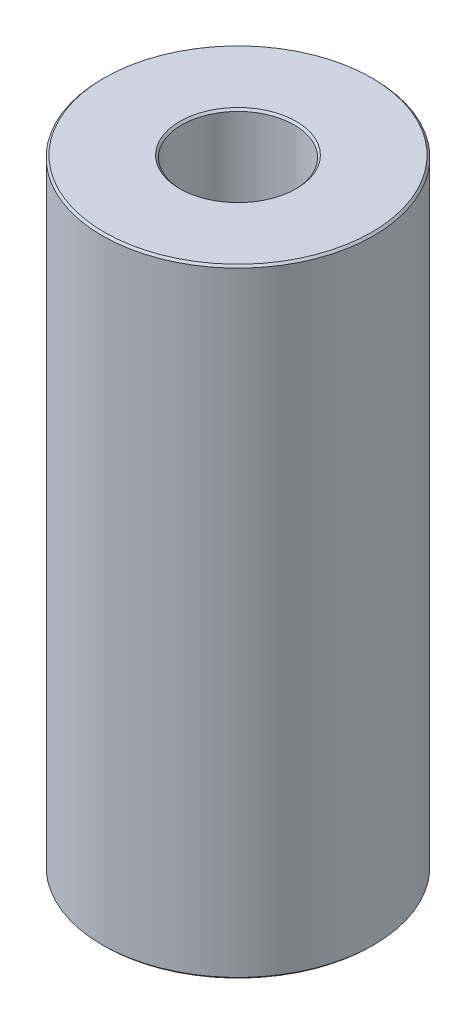
ISO-10303-21;
HEADER;
FILE_DESCRIPTION(('STEP AP214'),'2;1');
FILE_NAME('part.step','',(''),(''),'','','');
FILE_SCHEMA(('AUTOMOTIVE_DESIGN { 1 0 10303 214 1 1 1 1 }'));
ENDSEC;
DATA;
#1=APPLICATION_CONTEXT('core data for automotive mechanical design processes');
#2=APPLICATION_PROTOCOL_DEFINITION('international standard','automotive_design',2000,#1);
#3=PRODUCT_CONTEXT('',#1,'mechanical');
#4=PRODUCT('Part','Part','',(#3));
#5=PRODUCT_RELATED_PRODUCT_CATEGORY('part','',(#4));
#6=PRODUCT_DEFINITION_FORMATION('','',#4);
#7=PRODUCT_DEFINITION_CONTEXT('part definition',#1,'design');
#8=PRODUCT_DEFINITION('design','',#6,#7);
#9=PRODUCT_DEFINITION_SHAPE('','',#8);
#10=(LENGTH_UNIT() NAMED_UNIT(*) SI_UNIT(.MILLI.,.METRE.));
#11=(NAMED_UNIT(*) PLANE_ANGLE_UNIT() SI_UNIT($,.RADIAN.));
#12=(NAMED_UNIT(*) SI_UNIT($,.STERADIAN.) SOLID_ANGLE_UNIT());
#13=UNCERTAINTY_MEASURE_WITH_UNIT(LENGTH_MEASURE(1.E-05),#10,'distance_accuracy_value','');
#14=(GEOMETRIC_REPRESENTATION_CONTEXT(3) GLOBAL_UNCERTAINTY_ASSIGNED_CONTEXT((#13)) GLOBAL_UNIT_ASSIGNED_CONTEXT((#10,
#11,#12)) REPRESENTATION_CONTEXT('',''));
#15=CARTESIAN_POINT('',(0.,0.,0.));
#16=DIRECTION('',(0.,0.,1.));
#17=DIRECTION('',(1.,0.,0.));
#18=AXIS2_PLACEMENT_3D('',#15,#16,#17);
#19=CARTESIAN_POINT('',(0.,216.38670688983,0.));
#20=DIRECTION('',(0.,-1.,0.));
#21=DIRECTION('',(0.,0.,-1.));
#22=AXIS2_PLACEMENT_3D('',#19,#20,#21);
#23=CYLINDRICAL_SURFACE('',#22,47.5);
#24=CARTESIAN_POINT('',(0.,0.700210710462168,0.));
#25=DIRECTION('',(0.,1.,0.));
#26=DIRECTION('',(0.,0.,1.));
#27=AXIS2_PLACEMENT_3D('',#24,#25,#26);
#28=CIRCLE('',#27,47.5);
#29=CARTESIAN_POINT('',(0.,0.700210710462168,47.5));
#30=VERTEX_POINT('',#29);
#31=EDGE_CURVE('E10',#30,#30,#28,.T.);
#32=ORIENTED_EDGE('',*,*,#31,.T.);
#33=EDGE_LOOP('',(#32));
#34=FACE_BOUND('',#33,.T.);
#35=CARTESIAN_POINT('',(0.,215.686496179368,0.));
#36=DIRECTION('',(0.,1.,0.));
#37=DIRECTION('',(0.,0.,1.));
#38=AXIS2_PLACEMENT_3D('',#35,#36,#37);
#39=CIRCLE('',#38,47.5);
#40=CARTESIAN_POINT('',(0.,215.686496179368,47.5));
#41=VERTEX_POINT('',#40);
#42=EDGE_CURVE('E50',#41,#41,#39,.F.);
#43=ORIENTED_EDGE('',*,*,#42,.T.);
#44=EDGE_LOOP('',(#43));
#45=FACE_BOUND('',#44,.T.);
#46=ADVANCED_FACE('F39',(#34,#45),#23,.T.);
#47=CARTESIAN_POINT('',(0.,216.38670688983,0.));
#48=DIRECTION('',(0.,1.,0.));
#49=DIRECTION('',(0.,0.,1.));
#50=AXIS2_PLACEMENT_3D('',#47,#48,#49);
#51=PLANE('',#50);
#52=CARTESIAN_POINT('',(0.,216.38670688983,0.));
#53=DIRECTION('',(0.,1.,0.));
#54=DIRECTION('',(0.,0.,1.));
#55=AXIS2_PLACEMENT_3D('',#52,#53,#54);
#56=CIRCLE('',#55,20.4052724657314);
#57=CARTESIAN_POINT('',(0.,216.38670688983,20.4052724657314));
#58=VERTEX_POINT('',#57);
#59=EDGE_CURVE('E58',#58,#58,#56,.F.);
#60=ORIENTED_EDGE('',*,*,#59,.T.);
#61=EDGE_LOOP('',(#60));
#62=FACE_BOUND('',#61,.T.);
#63=CARTESIAN_POINT('',(0.,216.38670688983,0.));
#64=DIRECTION('',(0.,1.,0.));
#65=DIRECTION('',(0.,0.,1.));
#66=AXIS2_PLACEMENT_3D('',#63,#64,#65);
#67=CIRCLE('',#66,46.7997892895378);
#68=CARTESIAN_POINT('',(0.,216.38670688983,46.7997892895378));
#69=VERTEX_POINT('',#68);
#70=EDGE_CURVE('E61',#69,#69,#67,.T.);
#71=ORIENTED_EDGE('',*,*,#70,.T.);
#72=EDGE_LOOP('',(#71));
#73=FACE_BOUND('',#72,.T.);
#74=ADVANCED_FACE('F88',(#62,#73),#51,.T.);
#75=CARTESIAN_POINT('',(0.,0.,0.));
#76=DIRECTION('',(0.,1.,0.));
#77=DIRECTION('',(0.,0.,1.));
#78=AXIS2_PLACEMENT_3D('',#75,#76,#77);
#79=PLANE('',#78);
#80=CARTESIAN_POINT('',(0.,0.,0.));
#81=DIRECTION('',(0.,1.,0.));
#82=DIRECTION('',(0.,0.,1.));
#83=AXIS2_PLACEMENT_3D('',#80,#81,#82);
#84=CIRCLE('',#83,20.4052724657314);
#85=CARTESIAN_POINT('',(0.,0.,20.4052724657314));
#86=VERTEX_POINT('',#85);
#87=EDGE_CURVE('E51',#86,#86,#84,.T.);
#88=ORIENTED_EDGE('',*,*,#87,.T.);
#89=EDGE_LOOP('',(#88));
#90=FACE_BOUND('',#89,.T.);
#91=CARTESIAN_POINT('',(0.,0.,0.));
#92=DIRECTION('',(0.,1.,0.));
#93=DIRECTION('',(0.,0.,1.));
#94=AXIS2_PLACEMENT_3D('',#91,#92,#93);
#95=CIRCLE('',#94,46.7997892895378);
#96=CARTESIAN_POINT('',(0.,0.,46.7997892895378));
#97=VERTEX_POINT('',#96);
#98=EDGE_CURVE('E54',#97,#97,#95,.F.);
#99=ORIENTED_EDGE('',*,*,#98,.T.);
#100=EDGE_LOOP('',(#99));
#101=FACE_BOUND('',#100,.T.);
#102=ADVANCED_FACE('F83',(#90,#101),#79,.F.);
#103=CARTESIAN_POINT('',(0.,216.38670688983,0.));
#104=DIRECTION('',(0.,-1.,0.));
#105=DIRECTION('',(0.,0.,-1.));
#106=AXIS2_PLACEMENT_3D('',#103,#104,#105);
#107=CYLINDRICAL_SURFACE('',#106,19.7050617552692);
#108=CARTESIAN_POINT('',(0.,215.686496179368,0.));
#109=DIRECTION('',(0.,1.,0.));
#110=DIRECTION('',(0.,0.,1.));
#111=AXIS2_PLACEMENT_3D('',#108,#109,#110);
#112=CIRCLE('',#111,19.7050617552692);
#113=CARTESIAN_POINT('',(0.,215.686496179368,19.7050617552692));
#114=VERTEX_POINT('',#113);
#115=EDGE_CURVE('E67',#114,#114,#112,.T.);
#116=ORIENTED_EDGE('',*,*,#115,.T.);
#117=EDGE_LOOP('',(#116));
#118=FACE_BOUND('',#117,.T.);
#119=CARTESIAN_POINT('',(0.,0.700210710462223,0.));
#120=DIRECTION('',(0.,1.,0.));
#121=DIRECTION('',(0.,0.,1.));
#122=AXIS2_PLACEMENT_3D('',#119,#120,#121);
#123=CIRCLE('',#122,19.7050617552692);
#124=CARTESIAN_POINT('',(0.,0.700210710462223,19.7050617552692));
#125=VERTEX_POINT('',#124);
#126=EDGE_CURVE('E69',#125,#125,#123,.F.);
#127=ORIENTED_EDGE('',*,*,#126,.T.);
#128=EDGE_LOOP('',(#127));
#129=FACE_BOUND('',#128,.T.);
#130=ADVANCED_FACE('F71',(#118,#129),#107,.F.);
#131=CARTESIAN_POINT('',(0.,215.686496179368,0.));
#132=DIRECTION('',(0.,1.,0.));
#133=DIRECTION('',(0.,0.,1.));
#134=AXIS2_PLACEMENT_3D('',#131,#132,#133);
#135=CONICAL_SURFACE('',#134,19.7050617552692,0.785398163397451);
#136=ORIENTED_EDGE('',*,*,#59,.F.);
#137=EDGE_LOOP('',(#136));
#138=FACE_BOUND('',#137,.T.);
#139=ORIENTED_EDGE('',*,*,#115,.F.);
#140=EDGE_LOOP('',(#139));
#141=FACE_BOUND('',#140,.T.);
#142=ADVANCED_FACE('F77',(#138,#141),#135,.F.);
#143=CARTESIAN_POINT('',(0.,0.,0.));
#144=DIRECTION('',(0.,-1.,0.));
#145=DIRECTION('',(0.,0.,-1.));
#146=AXIS2_PLACEMENT_3D('',#143,#144,#145);
#147=CONICAL_SURFACE('',#146,20.4052724657314,0.785398163397451);
#148=ORIENTED_EDGE('',*,*,#126,.F.);
#149=EDGE_LOOP('',(#148));
#150=FACE_BOUND('',#149,.T.);
#151=ORIENTED_EDGE('',*,*,#87,.F.);
#152=EDGE_LOOP('',(#151));
#153=FACE_BOUND('',#152,.T.);
#154=ADVANCED_FACE('F73',(#150,#153),#147,.F.);
#155=CARTESIAN_POINT('',(0.,0.700210710462168,0.));
#156=DIRECTION('',(0.,1.,0.));
#157=DIRECTION('',(0.,0.,1.));
#158=AXIS2_PLACEMENT_3D('',#155,#156,#157);
#159=CONICAL_SURFACE('',#158,47.5,0.785398163397483);
#160=ORIENTED_EDGE('',*,*,#98,.F.);
#161=EDGE_LOOP('',(#160));
#162=FACE_BOUND('',#161,.T.);
#163=ORIENTED_EDGE('',*,*,#31,.F.);
#164=EDGE_LOOP('',(#163));
#165=FACE_BOUND('',#164,.T.);
#166=ADVANCED_FACE('F76',(#162,#165),#159,.T.);
#167=CARTESIAN_POINT('',(0.,216.38670688983,0.));
#168=DIRECTION('',(0.,-1.,0.));
#169=DIRECTION('',(0.,0.,-1.));
#170=AXIS2_PLACEMENT_3D('',#167,#168,#169);
#171=CONICAL_SURFACE('',#170,46.7997892895378,0.785398163397428);
#172=ORIENTED_EDGE('',*,*,#42,.F.);
#173=EDGE_LOOP('',(#172));
#174=FACE_BOUND('',#173,.T.);
#175=ORIENTED_EDGE('',*,*,#70,.F.);
#176=EDGE_LOOP('',(#175));
#177=FACE_BOUND('',#176,.T.);
#178=ADVANCED_FACE('F45',(#174,#177),#171,.T.);
#179=CLOSED_SHELL('',(#46,#74,#102,#130,#142,#154,#166,#178));
#180=MANIFOLD_SOLID_BREP('B2',#179);
#181=ADVANCED_BREP_SHAPE_REPRESENTATION('',(#18,#180),#14);
#182=SHAPE_DEFINITION_REPRESENTATION(#9,#181);
ENDSEC;
END-ISO-10303-21;
